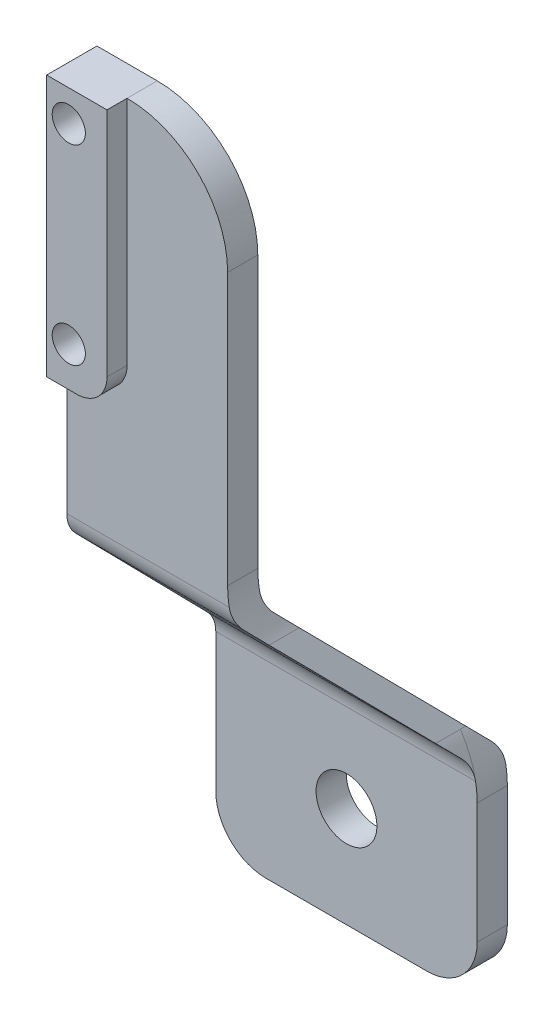
ISO-10303-21;
HEADER;
FILE_DESCRIPTION(('STEP AP214'),'2;1');
FILE_NAME('part.step','',(''),(''),'','','');
FILE_SCHEMA(('AUTOMOTIVE_DESIGN { 1 0 10303 214 1 1 1 1 }'));
ENDSEC;
DATA;
#1=APPLICATION_CONTEXT('core data for automotive mechanical design processes');
#2=APPLICATION_PROTOCOL_DEFINITION('international standard','automotive_design',2000,#1);
#3=PRODUCT_CONTEXT('',#1,'mechanical');
#4=PRODUCT('Part','Part','',(#3));
#5=PRODUCT_RELATED_PRODUCT_CATEGORY('part','',(#4));
#6=PRODUCT_DEFINITION_FORMATION('','',#4);
#7=PRODUCT_DEFINITION_CONTEXT('part definition',#1,'design');
#8=PRODUCT_DEFINITION('design','',#6,#7);
#9=PRODUCT_DEFINITION_SHAPE('','',#8);
#10=(LENGTH_UNIT() NAMED_UNIT(*) SI_UNIT(.MILLI.,.METRE.));
#11=(NAMED_UNIT(*) PLANE_ANGLE_UNIT() SI_UNIT($,.RADIAN.));
#12=(NAMED_UNIT(*) SI_UNIT($,.STERADIAN.) SOLID_ANGLE_UNIT());
#13=UNCERTAINTY_MEASURE_WITH_UNIT(LENGTH_MEASURE(1.E-05),#10,'distance_accuracy_value','');
#14=(GEOMETRIC_REPRESENTATION_CONTEXT(3) GLOBAL_UNCERTAINTY_ASSIGNED_CONTEXT((#13)) GLOBAL_UNIT_ASSIGNED_CONTEXT((#10,
#11,#12)) REPRESENTATION_CONTEXT('',''));
#15=CARTESIAN_POINT('',(0.,0.,0.));
#16=DIRECTION('',(0.,0.,1.));
#17=DIRECTION('',(1.,0.,0.));
#18=AXIS2_PLACEMENT_3D('',#15,#16,#17);
#19=CARTESIAN_POINT('',(0.,0.,0.));
#20=DIRECTION('',(0.,0.,-1.));
#21=DIRECTION('',(-1.,0.,0.));
#22=AXIS2_PLACEMENT_3D('',#19,#20,#21);
#23=PLANE('',#22);
#24=DIRECTION('',(1.,0.,0.));
#25=VECTOR('',#24,1.);
#26=CARTESIAN_POINT('',(-56.0000000000001,14.,0.));
#27=LINE('',#26,#25);
#28=CARTESIAN_POINT('',(-56.0000000000001,14.,0.));
#29=VERTEX_POINT('',#28);
#30=CARTESIAN_POINT('',(-53.0000000000001,14.,0.));
#31=VERTEX_POINT('',#30);
#32=EDGE_CURVE('E230',#29,#31,#27,.T.);
#33=ORIENTED_EDGE('',*,*,#32,.F.);
#34=DIRECTION('',(0.,-1.,0.));
#35=VECTOR('',#34,1.);
#36=CARTESIAN_POINT('',(-56.,0.,0.));
#37=LINE('',#36,#35);
#38=CARTESIAN_POINT('',(-56.,1.22622698302448,0.));
#39=VERTEX_POINT('',#38);
#40=EDGE_CURVE('E310',#29,#39,#37,.T.);
#41=ORIENTED_EDGE('',*,*,#40,.T.);
#42=DIRECTION('',(1.,0.,0.));
#43=VECTOR('',#42,1.);
#44=CARTESIAN_POINT('',(-40.,1.22622698302453,0.));
#45=LINE('',#44,#43);
#46=CARTESIAN_POINT('',(-39.8394318848504,1.22622698302453,0.));
#47=VERTEX_POINT('',#46);
#48=EDGE_CURVE('E324',#39,#47,#45,.T.);
#49=ORIENTED_EDGE('',*,*,#48,.T.);
#50=CARTESIAN_POINT('',(-30.,3.01104635298569,0.));
#51=DIRECTION('',(0.,0.,-1.));
#52=DIRECTION('',(-1.,0.,0.));
#53=AXIS2_PLACEMENT_3D('',#50,#51,#52);
#54=CIRCLE('',#53,10.);
#55=CARTESIAN_POINT('',(-40.,3.01104635298566,0.));
#56=VERTEX_POINT('',#55);
#57=EDGE_CURVE('E436',#47,#56,#54,.T.);
#58=ORIENTED_EDGE('',*,*,#57,.T.);
#59=DIRECTION('',(0.,1.,0.));
#60=VECTOR('',#59,1.);
#61=CARTESIAN_POINT('',(-40.,0.,0.));
#62=LINE('',#61,#60);
#63=CARTESIAN_POINT('',(-40.0000000000001,30.,0.));
#64=VERTEX_POINT('',#63);
#65=EDGE_CURVE('E424',#56,#64,#62,.T.);
#66=ORIENTED_EDGE('',*,*,#65,.T.);
#67=CARTESIAN_POINT('',(-50.0000000000001,30.,0.));
#68=DIRECTION('',(0.,0.,-1.));
#69=DIRECTION('',(-1.,0.,0.));
#70=AXIS2_PLACEMENT_3D('',#67,#68,#69);
#71=CIRCLE('',#70,10.);
#72=CARTESIAN_POINT('',(-50.0000000000001,40.,0.));
#73=VERTEX_POINT('',#72);
#74=EDGE_CURVE('E484',#64,#73,#71,.F.);
#75=ORIENTED_EDGE('',*,*,#74,.T.);
#76=DIRECTION('',(0.,1.,0.));
#77=VECTOR('',#76,1.);
#78=CARTESIAN_POINT('',(-50.0000000000001,40.,0.));
#79=LINE('',#78,#77);
#80=CARTESIAN_POINT('',(-50.0000000000001,17.,0.));
#81=VERTEX_POINT('',#80);
#82=EDGE_CURVE('E228',#81,#73,#79,.T.);
#83=ORIENTED_EDGE('',*,*,#82,.F.);
#84=CARTESIAN_POINT('',(-53.0000000000001,17.,0.));
#85=DIRECTION('',(0.,0.,-1.));
#86=DIRECTION('',(-1.,0.,0.));
#87=AXIS2_PLACEMENT_3D('',#84,#85,#86);
#88=CIRCLE('',#87,3.);
#89=EDGE_CURVE('E335',#81,#31,#88,.T.);
#90=ORIENTED_EDGE('',*,*,#89,.T.);
#91=EDGE_LOOP('',(#33,#41,#49,#58,#66,#75,#83,#90));
#92=FACE_BOUND('',#91,.T.);
#93=ADVANCED_FACE('F42',(#92),#23,.F.);
#94=CARTESIAN_POINT('',(-56.,0.,-3.));
#95=DIRECTION('',(-1.,0.,0.));
#96=DIRECTION('',(0.,-1.,0.));
#97=AXIS2_PLACEMENT_3D('',#94,#95,#96);
#98=PLANE('',#97);
#99=DIRECTION('',(0.,0.713692839578513,0.700458800169117));
#100=VECTOR('',#99,1.);
#101=CARTESIAN_POINT('',(-56.,-15.1,-17.82));
#102=LINE('',#101,#100);
#103=CARTESIAN_POINT('',(-56.,-14.2248505825174,-16.9610785187355));
#104=VERTEX_POINT('',#103);
#105=CARTESIAN_POINT('',(-56.,-0.875149417482865,-3.85892148126446));
#106=VERTEX_POINT('',#105);
#107=EDGE_CURVE('E267',#104,#106,#102,.T.);
#108=ORIENTED_EDGE('',*,*,#107,.F.);
#109=CARTESIAN_POINT('',(-56.,-16.3262269830247,-14.82));
#110=DIRECTION('',(-1.,0.,0.));
#111=DIRECTION('',(0.,-1.,0.));
#112=AXIS2_PLACEMENT_3D('',#109,#110,#111);
#113=CIRCLE('',#112,3.);
#114=CARTESIAN_POINT('',(-56.,-16.3262269830247,-17.82));
#115=VERTEX_POINT('',#114);
#116=EDGE_CURVE('E319',#104,#115,#113,.T.);
#117=ORIENTED_EDGE('',*,*,#116,.T.);
#118=DIRECTION('',(0.,-1.,0.));
#119=VECTOR('',#118,1.);
#120=CARTESIAN_POINT('',(-56.,-15.1,-17.82));
#121=LINE('',#120,#119);
#122=CARTESIAN_POINT('',(-56.,-30.1000000000001,-17.82));
#123=VERTEX_POINT('',#122);
#124=EDGE_CURVE('E254',#115,#123,#121,.T.);
#125=ORIENTED_EDGE('',*,*,#124,.T.);
#126=DIRECTION('',(0.,0.,-1.));
#127=VECTOR('',#126,1.);
#128=CARTESIAN_POINT('',(-55.9999999999999,-30.1000000000001,-14.82));
#129=LINE('',#128,#127);
#130=CARTESIAN_POINT('',(-56.,-30.1000000000001,-14.82));
#131=VERTEX_POINT('',#130);
#132=EDGE_CURVE('E494',#123,#131,#129,.F.);
#133=ORIENTED_EDGE('',*,*,#132,.T.);
#134=DIRECTION('',(0.,-1.,0.));
#135=VECTOR('',#134,1.);
#136=CARTESIAN_POINT('',(-56.,-15.1,-14.82));
#137=LINE('',#136,#135);
#138=CARTESIAN_POINT('',(-56.,-16.3262269830248,-14.82));
#139=VERTEX_POINT('',#138);
#140=EDGE_CURVE('E274',#139,#131,#137,.T.);
#141=ORIENTED_EDGE('',*,*,#140,.F.);
#142=CARTESIAN_POINT('',(-56.,-16.3262269830248,-11.82));
#143=DIRECTION('',(-1.,0.,0.));
#144=DIRECTION('',(0.,-1.,0.));
#145=AXIS2_PLACEMENT_3D('',#142,#143,#144);
#146=CIRCLE('',#145,3.);
#147=CARTESIAN_POINT('',(-56.,-14.2248505825174,-13.9610785187356));
#148=VERTEX_POINT('',#147);
#149=EDGE_CURVE('E294',#139,#148,#146,.F.);
#150=ORIENTED_EDGE('',*,*,#149,.T.);
#151=DIRECTION('',(0.,0.713692839578513,0.700458800169117));
#152=VECTOR('',#151,1.);
#153=CARTESIAN_POINT('',(-56.,-15.1,-14.82));
#154=LINE('',#153,#152);
#155=CARTESIAN_POINT('',(-56.,-0.875149417482861,-0.858921481264456));
#156=VERTEX_POINT('',#155);
#157=EDGE_CURVE('E263',#148,#156,#154,.T.);
#158=ORIENTED_EDGE('',*,*,#157,.T.);
#159=CARTESIAN_POINT('',(-56.,1.22622698302448,-3.));
#160=DIRECTION('',(-1.,0.,0.));
#161=DIRECTION('',(0.,-1.,0.));
#162=AXIS2_PLACEMENT_3D('',#159,#160,#161);
#163=CIRCLE('',#162,3.);
#164=EDGE_CURVE('E316',#156,#39,#163,.T.);
#165=ORIENTED_EDGE('',*,*,#164,.T.);
#166=ORIENTED_EDGE('',*,*,#40,.F.);
#167=DIRECTION('',(0.,0.,-1.));
#168=VECTOR('',#167,1.);
#169=CARTESIAN_POINT('',(-56.0000000000001,14.,2.));
#170=LINE('',#169,#168);
#171=CARTESIAN_POINT('',(-56.0000000000001,14.,2.));
#172=VERTEX_POINT('',#171);
#173=EDGE_CURVE('E217',#172,#29,#170,.T.);
#174=ORIENTED_EDGE('',*,*,#173,.F.);
#175=DIRECTION('',(0.,-1.,0.));
#176=VECTOR('',#175,1.);
#177=CARTESIAN_POINT('',(-56.0000000000001,40.,2.));
#178=LINE('',#177,#176);
#179=CARTESIAN_POINT('',(-56.0000000000001,40.,2.));
#180=VERTEX_POINT('',#179);
#181=EDGE_CURVE('E212',#180,#172,#178,.T.);
#182=ORIENTED_EDGE('',*,*,#181,.F.);
#183=DIRECTION('',(0.,0.,1.));
#184=VECTOR('',#183,1.);
#185=CARTESIAN_POINT('',(-56.0000000000001,40.,-3.));
#186=LINE('',#185,#184);
#187=CARTESIAN_POINT('',(-56.0000000000001,40.,-3.));
#188=VERTEX_POINT('',#187);
#189=EDGE_CURVE('E198',#188,#180,#186,.T.);
#190=ORIENTED_EDGE('',*,*,#189,.F.);
#191=DIRECTION('',(0.,-1.,0.));
#192=VECTOR('',#191,1.);
#193=CARTESIAN_POINT('',(-56.,0.,-3.));
#194=LINE('',#193,#192);
#195=CARTESIAN_POINT('',(-56.,1.22622698302448,-3.));
#196=VERTEX_POINT('',#195);
#197=EDGE_CURVE('E209',#188,#196,#194,.T.);
#198=ORIENTED_EDGE('',*,*,#197,.T.);
#199=CARTESIAN_POINT('',(-56.,1.22622698302448,-6.));
#200=DIRECTION('',(-1.,0.,0.));
#201=DIRECTION('',(0.,-1.,0.));
#202=AXIS2_PLACEMENT_3D('',#199,#200,#201);
#203=CIRCLE('',#202,3.);
#204=EDGE_CURVE('E291',#196,#106,#203,.F.);
#205=ORIENTED_EDGE('',*,*,#204,.T.);
#206=EDGE_LOOP('',(#108,#117,#125,#133,#141,#150,#158,#165,#166,#174,#182,#190,#198,#205));
#207=FACE_BOUND('',#206,.T.);
#208=ADVANCED_FACE('F214',(#207),#98,.T.);
#209=CARTESIAN_POINT('',(-40.0000000000001,40.,-3.));
#210=DIRECTION('',(0.,1.,0.));
#211=DIRECTION('',(-1.,0.,0.));
#212=AXIS2_PLACEMENT_3D('',#209,#210,#211);
#213=PLANE('',#212);
#214=ORIENTED_EDGE('',*,*,#189,.T.);
#215=DIRECTION('',(-1.,0.,0.));
#216=VECTOR('',#215,1.);
#217=CARTESIAN_POINT('',(-50.0000000000001,40.,2.));
#218=LINE('',#217,#216);
#219=CARTESIAN_POINT('',(-50.0000000000001,40.,2.));
#220=VERTEX_POINT('',#219);
#221=EDGE_CURVE('E203',#220,#180,#218,.T.);
#222=ORIENTED_EDGE('',*,*,#221,.F.);
#223=DIRECTION('',(0.,0.,-1.));
#224=VECTOR('',#223,1.);
#225=CARTESIAN_POINT('',(-50.0000000000001,40.,2.));
#226=LINE('',#225,#224);
#227=EDGE_CURVE('E238',#220,#73,#226,.T.);
#228=ORIENTED_EDGE('',*,*,#227,.T.);
#229=DIRECTION('',(0.,0.,1.));
#230=VECTOR('',#229,1.);
#231=CARTESIAN_POINT('',(-50.0000000000001,40.,-3.));
#232=LINE('',#231,#230);
#233=CARTESIAN_POINT('',(-50.0000000000001,40.,-3.));
#234=VERTEX_POINT('',#233);
#235=EDGE_CURVE('E482',#73,#234,#232,.F.);
#236=ORIENTED_EDGE('',*,*,#235,.T.);
#237=DIRECTION('',(-1.,0.,0.));
#238=VECTOR('',#237,1.);
#239=CARTESIAN_POINT('',(-40.0000000000001,40.,-3.));
#240=LINE('',#239,#238);
#241=EDGE_CURVE('E205',#234,#188,#240,.T.);
#242=ORIENTED_EDGE('',*,*,#241,.T.);
#243=EDGE_LOOP('',(#214,#222,#228,#236,#242));
#244=FACE_BOUND('',#243,.T.);
#245=ADVANCED_FACE('F200',(#244),#213,.T.);
#246=CARTESIAN_POINT('',(-40.,0.,-3.));
#247=DIRECTION('',(1.,0.,0.));
#248=DIRECTION('',(0.,1.,0.));
#249=AXIS2_PLACEMENT_3D('',#246,#247,#248);
#250=PLANE('',#249);
#251=ORIENTED_EDGE('',*,*,#65,.F.);
#252=DIRECTION('',(0.,0.,1.));
#253=VECTOR('',#252,1.);
#254=CARTESIAN_POINT('',(-40.,3.01104635298566,-3.26205051432606));
#255=LINE('',#254,#253);
#256=CARTESIAN_POINT('',(-40.,3.01104635298566,-3.));
#257=VERTEX_POINT('',#256);
#258=EDGE_CURVE('E426',#56,#257,#255,.F.);
#259=ORIENTED_EDGE('',*,*,#258,.T.);
#260=DIRECTION('',(0.,1.,0.));
#261=VECTOR('',#260,1.);
#262=CARTESIAN_POINT('',(-40.,0.,-3.));
#263=LINE('',#262,#261);
#264=CARTESIAN_POINT('',(-40.0000000000001,30.,-3.));
#265=VERTEX_POINT('',#264);
#266=EDGE_CURVE('E540',#257,#265,#263,.T.);
#267=ORIENTED_EDGE('',*,*,#266,.T.);
#268=DIRECTION('',(0.,0.,1.));
#269=VECTOR('',#268,1.);
#270=CARTESIAN_POINT('',(-40.0000000000001,30.,-3.));
#271=LINE('',#270,#269);
#272=EDGE_CURVE('E428',#265,#64,#271,.T.);
#273=ORIENTED_EDGE('',*,*,#272,.T.);
#274=EDGE_LOOP('',(#251,#259,#267,#273));
#275=FACE_BOUND('',#274,.T.);
#276=ADVANCED_FACE('F414',(#275),#250,.T.);
#277=CARTESIAN_POINT('',(0.,0.,-3.));
#278=DIRECTION('',(0.,0.,-1.));
#279=DIRECTION('',(-1.,0.,0.));
#280=AXIS2_PLACEMENT_3D('',#277,#278,#279);
#281=PLANE('',#280);
#282=CARTESIAN_POINT('',(-53.8000000000001,17.9,-3.));
#283=DIRECTION('',(0.,0.,1.));
#284=DIRECTION('',(1.,0.,0.));
#285=AXIS2_PLACEMENT_3D('',#282,#283,#284);
#286=CIRCLE('',#285,1.64999999999999);
#287=CARTESIAN_POINT('',(-52.1500000000001,17.9,-3.));
#288=VERTEX_POINT('',#287);
#289=EDGE_CURVE('E476',#288,#288,#286,.T.);
#290=ORIENTED_EDGE('',*,*,#289,.T.);
#291=EDGE_LOOP('',(#290));
#292=FACE_BOUND('',#291,.T.);
#293=CARTESIAN_POINT('',(-53.8000000000001,36.9,-3.));
#294=DIRECTION('',(0.,0.,1.));
#295=DIRECTION('',(1.,0.,0.));
#296=AXIS2_PLACEMENT_3D('',#293,#294,#295);
#297=CIRCLE('',#296,1.64999999999998);
#298=CARTESIAN_POINT('',(-52.1500000000002,36.9,-3.));
#299=VERTEX_POINT('',#298);
#300=EDGE_CURVE('E431',#299,#299,#297,.T.);
#301=ORIENTED_EDGE('',*,*,#300,.T.);
#302=EDGE_LOOP('',(#301));
#303=FACE_BOUND('',#302,.T.);
#304=ORIENTED_EDGE('',*,*,#241,.F.);
#305=CARTESIAN_POINT('',(-50.0000000000001,30.,-3.));
#306=DIRECTION('',(0.,0.,-1.));
#307=DIRECTION('',(-1.,0.,0.));
#308=AXIS2_PLACEMENT_3D('',#305,#306,#307);
#309=CIRCLE('',#308,10.);
#310=EDGE_CURVE('E479',#234,#265,#309,.T.);
#311=ORIENTED_EDGE('',*,*,#310,.T.);
#312=ORIENTED_EDGE('',*,*,#266,.F.);
#313=CARTESIAN_POINT('',(-30.,3.01104635298569,-3.));
#314=DIRECTION('',(0.,0.,-1.));
#315=DIRECTION('',(-1.,0.,0.));
#316=AXIS2_PLACEMENT_3D('',#313,#314,#315);
#317=CIRCLE('',#316,10.);
#318=CARTESIAN_POINT('',(-39.8394318848505,1.22622698302454,-3.));
#319=VERTEX_POINT('',#318);
#320=EDGE_CURVE('E288',#257,#319,#317,.F.);
#321=ORIENTED_EDGE('',*,*,#320,.T.);
#322=DIRECTION('',(1.,0.,0.));
#323=VECTOR('',#322,1.);
#324=CARTESIAN_POINT('',(-56.,1.22622698302448,-3.));
#325=LINE('',#324,#323);
#326=EDGE_CURVE('E65',#319,#196,#325,.F.);
#327=ORIENTED_EDGE('',*,*,#326,.T.);
#328=ORIENTED_EDGE('',*,*,#197,.F.);
#329=EDGE_LOOP('',(#304,#311,#312,#321,#327,#328));
#330=FACE_BOUND('',#329,.T.);
#331=ADVANCED_FACE('F285',(#292,#303,#330),#281,.T.);
#332=CARTESIAN_POINT('',(-53.8000000000001,36.9,-3.));
#333=DIRECTION('',(0.,0.,1.));
#334=DIRECTION('',(1.,0.,0.));
#335=AXIS2_PLACEMENT_3D('',#332,#333,#334);
#336=CYLINDRICAL_SURFACE('',#335,1.64999999999998);
#337=ORIENTED_EDGE('',*,*,#300,.F.);
#338=EDGE_LOOP('',(#337));
#339=FACE_BOUND('',#338,.T.);
#340=CARTESIAN_POINT('',(-53.8000000000001,36.9,2.));
#341=DIRECTION('',(0.,0.,1.));
#342=DIRECTION('',(1.,0.,0.));
#343=AXIS2_PLACEMENT_3D('',#340,#341,#342);
#344=CIRCLE('',#343,1.64999999999999);
#345=CARTESIAN_POINT('',(-52.1500000000001,36.9,2.));
#346=VERTEX_POINT('',#345);
#347=EDGE_CURVE('E233',#346,#346,#344,.T.);
#348=ORIENTED_EDGE('',*,*,#347,.T.);
#349=EDGE_LOOP('',(#348));
#350=FACE_BOUND('',#349,.T.);
#351=ADVANCED_FACE('F420',(#339,#350),#336,.F.);
#352=CARTESIAN_POINT('',(-53.8000000000001,17.9,-3.));
#353=DIRECTION('',(0.,0.,1.));
#354=DIRECTION('',(1.,0.,0.));
#355=AXIS2_PLACEMENT_3D('',#352,#353,#354);
#356=CYLINDRICAL_SURFACE('',#355,1.64999999999999);
#357=ORIENTED_EDGE('',*,*,#289,.F.);
#358=EDGE_LOOP('',(#357));
#359=FACE_BOUND('',#358,.T.);
#360=CARTESIAN_POINT('',(-53.8000000000001,17.9,2.));
#361=DIRECTION('',(0.,0.,1.));
#362=DIRECTION('',(1.,0.,0.));
#363=AXIS2_PLACEMENT_3D('',#360,#361,#362);
#364=CIRCLE('',#363,1.65);
#365=CARTESIAN_POINT('',(-52.1500000000001,17.9,2.));
#366=VERTEX_POINT('',#365);
#367=EDGE_CURVE('E564',#366,#366,#364,.T.);
#368=ORIENTED_EDGE('',*,*,#367,.T.);
#369=EDGE_LOOP('',(#368));
#370=FACE_BOUND('',#369,.T.);
#371=ADVANCED_FACE('F558',(#359,#370),#356,.F.);
#372=CARTESIAN_POINT('',(0.,1.49973729030137,-1.52807240779692));
#373=DIRECTION('',(0.,0.700458800169117,-0.713692839578513));
#374=DIRECTION('',(0.,0.713692839578513,0.700458800169117));
#375=AXIS2_PLACEMENT_3D('',#372,#373,#374);
#376=PLANE('',#375);
#377=DIRECTION('',(-0.427318275895479,0.64525059660217,0.633285684877101));
#378=VECTOR('',#377,1.);
#379=CARTESIAN_POINT('',(-30.,-15.1,-17.82));
#380=LINE('',#379,#378);
#381=CARTESIAN_POINT('',(-31.6625468757024,-12.5895542176894,-15.356105530209));
#382=VERTEX_POINT('',#381);
#383=CARTESIAN_POINT('',(-38.3374531242976,-2.51044578231076,-5.46389446979097));
#384=VERTEX_POINT('',#383);
#385=EDGE_CURVE('E278',#382,#384,#380,.T.);
#386=ORIENTED_EDGE('',*,*,#385,.F.);
#387=CARTESIAN_POINT('',(-40.,-18.1110463529858,-20.7752123808775));
#388=DIRECTION('',(0.,0.700458800169117,-0.713692839578513));
#389=DIRECTION('',(0.,0.713692839578513,0.700458800169117));
#390=AXIS2_PLACEMENT_3D('',#387,#388,#389);
#391=ELLIPSE('',#390,14.011629997445,10.);
#392=CARTESIAN_POINT('',(-30.7860170157748,-14.2248505825173,-16.9610785187355));
#393=VERTEX_POINT('',#392);
#394=EDGE_CURVE('E387',#382,#393,#391,.T.);
#395=ORIENTED_EDGE('',*,*,#394,.T.);
#396=DIRECTION('',(-1.,0.,0.));
#397=VECTOR('',#396,1.);
#398=CARTESIAN_POINT('',(-56.,-14.2248505825174,-16.9610785187355));
#399=LINE('',#398,#397);
#400=EDGE_CURVE('E314',#393,#104,#399,.T.);
#401=ORIENTED_EDGE('',*,*,#400,.T.);
#402=ORIENTED_EDGE('',*,*,#107,.T.);
#403=DIRECTION('',(1.,0.,0.));
#404=VECTOR('',#403,1.);
#405=CARTESIAN_POINT('',(-40.,-0.875149417482812,-3.85892148126446));
#406=LINE('',#405,#404);
#407=CARTESIAN_POINT('',(-39.2139829842253,-0.87514941748281,-3.85892148126446));
#408=VERTEX_POINT('',#407);
#409=EDGE_CURVE('E58',#106,#408,#406,.T.);
#410=ORIENTED_EDGE('',*,*,#409,.T.);
#411=CARTESIAN_POINT('',(-30.,3.01104635298569,-0.044787619122518));
#412=DIRECTION('',(0.,0.700458800169117,-0.713692839578513));
#413=DIRECTION('',(0.,-0.713692839578513,-0.700458800169117));
#414=AXIS2_PLACEMENT_3D('',#411,#412,#413);
#415=ELLIPSE('',#414,14.011629997445,10.);
#416=EDGE_CURVE('E12',#408,#384,#415,.F.);
#417=ORIENTED_EDGE('',*,*,#416,.T.);
#418=EDGE_LOOP('',(#386,#395,#401,#402,#410,#417));
#419=FACE_BOUND('',#418,.T.);
#420=ADVANCED_FACE('F461',(#419),#376,.T.);
#421=CARTESIAN_POINT('',(0.,0.,0.));
#422=DIRECTION('',(0.,-0.700458800169115,0.713692839578515));
#423=DIRECTION('',(0.,-0.713692839578515,-0.700458800169115));
#424=AXIS2_PLACEMENT_3D('',#421,#422,#423);
#425=PLANE('',#424);
#426=DIRECTION('',(1.,0.,0.));
#427=VECTOR('',#426,1.);
#428=CARTESIAN_POINT('',(-30.,-14.2248505825174,-13.9610785187355));
#429=LINE('',#428,#427);
#430=CARTESIAN_POINT('',(-30.7860170157747,-14.2248505825174,-13.9610785187355));
#431=VERTEX_POINT('',#430);
#432=EDGE_CURVE('E270',#148,#431,#429,.T.);
#433=ORIENTED_EDGE('',*,*,#432,.T.);
#434=CARTESIAN_POINT('',(-40.,-18.1110463529858,-17.7752123808774));
#435=DIRECTION('',(0.,-0.700458800169115,0.713692839578515));
#436=DIRECTION('',(0.,-0.713692839578515,-0.700458800169115));
#437=AXIS2_PLACEMENT_3D('',#434,#435,#436);
#438=ELLIPSE('',#437,14.011629997445,10.);
#439=CARTESIAN_POINT('',(-31.6625468757024,-12.5895542176894,-12.356105530209));
#440=VERTEX_POINT('',#439);
#441=EDGE_CURVE('E347',#431,#440,#438,.T.);
#442=ORIENTED_EDGE('',*,*,#441,.T.);
#443=DIRECTION('',(-0.427318275895479,0.64525059660217,0.633285684877101));
#444=VECTOR('',#443,1.);
#445=CARTESIAN_POINT('',(-30.,-15.1,-14.82));
#446=LINE('',#445,#444);
#447=CARTESIAN_POINT('',(-38.3374531242976,-2.51044578231076,-2.46389446979097));
#448=VERTEX_POINT('',#447);
#449=EDGE_CURVE('E268',#440,#448,#446,.T.);
#450=ORIENTED_EDGE('',*,*,#449,.T.);
#451=CARTESIAN_POINT('',(-30.,3.01104635298569,2.95521238087747));
#452=DIRECTION('',(0.,-0.700458800169115,0.713692839578515));
#453=DIRECTION('',(0.,-0.713692839578515,-0.700458800169115));
#454=AXIS2_PLACEMENT_3D('',#451,#452,#453);
#455=ELLIPSE('',#454,14.011629997445,10.);
#456=CARTESIAN_POINT('',(-39.2139829842253,-0.875149417482809,-0.858921481264456));
#457=VERTEX_POINT('',#456);
#458=EDGE_CURVE('E437',#448,#457,#455,.F.);
#459=ORIENTED_EDGE('',*,*,#458,.T.);
#460=DIRECTION('',(1.,0.,0.));
#461=VECTOR('',#460,1.);
#462=CARTESIAN_POINT('',(-56.,-0.875149417482867,-0.858921481264456));
#463=LINE('',#462,#461);
#464=EDGE_CURVE('E326',#457,#156,#463,.F.);
#465=ORIENTED_EDGE('',*,*,#464,.T.);
#466=ORIENTED_EDGE('',*,*,#157,.F.);
#467=EDGE_LOOP('',(#433,#442,#450,#459,#465,#466));
#468=FACE_BOUND('',#467,.T.);
#469=ADVANCED_FACE('F537',(#468),#425,.T.);
#470=CARTESIAN_POINT('',(-27.8052498399439,-18.4140727416848,0.));
#471=DIRECTION('',(0.833745312429758,0.552149213529645,0.));
#472=DIRECTION('',(-0.552149213529645,0.833745312429758,0.));
#473=AXIS2_PLACEMENT_3D('',#470,#471,#472);
#474=PLANE('',#473);
#475=ORIENTED_EDGE('',*,*,#449,.F.);
#476=DIRECTION('',(0.,0.,1.));
#477=VECTOR('',#476,1.);
#478=CARTESIAN_POINT('',(-31.6625468757024,-12.5895542176894,-14.82));
#479=LINE('',#478,#477);
#480=CARTESIAN_POINT('',(-31.6625468757024,-12.5895542176894,-14.82));
#481=VERTEX_POINT('',#480);
#482=EDGE_CURVE('E529',#440,#481,#479,.F.);
#483=ORIENTED_EDGE('',*,*,#482,.T.);
#484=DIRECTION('',(0.,0.,-1.));
#485=VECTOR('',#484,1.);
#486=CARTESIAN_POINT('',(-31.6625468757024,-12.5895542176894,-17.557949485674));
#487=LINE('',#486,#485);
#488=EDGE_CURVE('E468',#481,#382,#487,.T.);
#489=ORIENTED_EDGE('',*,*,#488,.T.);
#490=ORIENTED_EDGE('',*,*,#385,.T.);
#491=DIRECTION('',(0.,0.,1.));
#492=VECTOR('',#491,1.);
#493=CARTESIAN_POINT('',(-38.3374531242976,-2.51044578231076,-0.262050514326052));
#494=LINE('',#493,#492);
#495=EDGE_CURVE('E458',#384,#448,#494,.T.);
#496=ORIENTED_EDGE('',*,*,#495,.T.);
#497=EDGE_LOOP('',(#475,#483,#489,#490,#496));
#498=FACE_BOUND('',#497,.T.);
#499=ADVANCED_FACE('F464',(#498),#474,.T.);
#500=CARTESIAN_POINT('',(0.,0.,-14.82));
#501=DIRECTION('',(0.,0.,1.));
#502=DIRECTION('',(1.,0.,0.));
#503=AXIS2_PLACEMENT_3D('',#500,#501,#502);
#504=PLANE('',#503);
#505=DIRECTION('',(0.,1.,0.));
#506=VECTOR('',#505,1.);
#507=CARTESIAN_POINT('',(-30.,-15.1,-14.82));
#508=LINE('',#507,#506);
#509=CARTESIAN_POINT('',(-30.,-30.1,-14.82));
#510=VERTEX_POINT('',#509);
#511=CARTESIAN_POINT('',(-30.,-18.1110463529858,-14.82));
#512=VERTEX_POINT('',#511);
#513=EDGE_CURVE('E253',#510,#512,#508,.T.);
#514=ORIENTED_EDGE('',*,*,#513,.T.);
#515=CARTESIAN_POINT('',(-40.,-18.1110463529858,-14.82));
#516=DIRECTION('',(0.,0.,1.));
#517=DIRECTION('',(1.,0.,0.));
#518=AXIS2_PLACEMENT_3D('',#515,#516,#517);
#519=CIRCLE('',#518,10.);
#520=CARTESIAN_POINT('',(-30.1605681151496,-16.3262269830247,-14.82));
#521=VERTEX_POINT('',#520);
#522=EDGE_CURVE('E337',#512,#521,#519,.T.);
#523=ORIENTED_EDGE('',*,*,#522,.T.);
#524=DIRECTION('',(1.,0.,0.));
#525=VECTOR('',#524,1.);
#526=CARTESIAN_POINT('',(-56.,-16.3262269830248,-14.82));
#527=LINE('',#526,#525);
#528=EDGE_CURVE('E273',#521,#139,#527,.F.);
#529=ORIENTED_EDGE('',*,*,#528,.T.);
#530=ORIENTED_EDGE('',*,*,#140,.T.);
#531=CARTESIAN_POINT('',(-50.9999999999999,-30.1,-14.82));
#532=DIRECTION('',(0.,0.,1.));
#533=DIRECTION('',(1.,0.,0.));
#534=AXIS2_PLACEMENT_3D('',#531,#532,#533);
#535=CIRCLE('',#534,5.);
#536=CARTESIAN_POINT('',(-50.9999999999999,-35.1,-14.82));
#537=VERTEX_POINT('',#536);
#538=EDGE_CURVE('E490',#131,#537,#535,.T.);
#539=ORIENTED_EDGE('',*,*,#538,.T.);
#540=DIRECTION('',(1.,0.,0.));
#541=VECTOR('',#540,1.);
#542=CARTESIAN_POINT('',(-30.,-35.1,-14.82));
#543=LINE('',#542,#541);
#544=CARTESIAN_POINT('',(-35.,-35.1,-14.82));
#545=VERTEX_POINT('',#544);
#546=EDGE_CURVE('E250',#537,#545,#543,.T.);
#547=ORIENTED_EDGE('',*,*,#546,.T.);
#548=CARTESIAN_POINT('',(-35.,-30.1,-14.82));
#549=DIRECTION('',(0.,0.,1.));
#550=DIRECTION('',(1.,0.,0.));
#551=AXIS2_PLACEMENT_3D('',#548,#549,#550);
#552=CIRCLE('',#551,5.);
#553=EDGE_CURVE('E492',#545,#510,#552,.T.);
#554=ORIENTED_EDGE('',*,*,#553,.T.);
#555=EDGE_LOOP('',(#514,#523,#529,#530,#539,#547,#554));
#556=FACE_BOUND('',#555,.T.);
#557=CARTESIAN_POINT('',(-43.,-25.1,-14.82));
#558=DIRECTION('',(0.,0.,1.));
#559=DIRECTION('',(-1.,0.,0.));
#560=AXIS2_PLACEMENT_3D('',#557,#558,#559);
#561=CIRCLE('',#560,3.025);
#562=CARTESIAN_POINT('',(-46.025,-25.1,-14.82));
#563=VERTEX_POINT('',#562);
#564=EDGE_CURVE('E244',#563,#563,#561,.T.);
#565=ORIENTED_EDGE('',*,*,#564,.F.);
#566=EDGE_LOOP('',(#565));
#567=FACE_BOUND('',#566,.T.);
#568=ADVANCED_FACE('F515',(#556,#567),#504,.T.);
#569=CARTESIAN_POINT('',(0.,0.,-17.82));
#570=DIRECTION('',(0.,0.,1.));
#571=DIRECTION('',(1.,0.,0.));
#572=AXIS2_PLACEMENT_3D('',#569,#570,#571);
#573=PLANE('',#572);
#574=DIRECTION('',(-1.,0.,0.));
#575=VECTOR('',#574,1.);
#576=CARTESIAN_POINT('',(-30.,-16.3262269830246,-17.82));
#577=LINE('',#576,#575);
#578=CARTESIAN_POINT('',(-30.1605681151496,-16.3262269830246,-17.82));
#579=VERTEX_POINT('',#578);
#580=EDGE_CURVE('E321',#115,#579,#577,.F.);
#581=ORIENTED_EDGE('',*,*,#580,.T.);
#582=CARTESIAN_POINT('',(-40.,-18.1110463529858,-17.82));
#583=DIRECTION('',(0.,0.,1.));
#584=DIRECTION('',(1.,0.,0.));
#585=AXIS2_PLACEMENT_3D('',#582,#583,#584);
#586=CIRCLE('',#585,10.);
#587=CARTESIAN_POINT('',(-30.,-18.1110463529858,-17.82));
#588=VERTEX_POINT('',#587);
#589=EDGE_CURVE('E386',#579,#588,#586,.F.);
#590=ORIENTED_EDGE('',*,*,#589,.T.);
#591=DIRECTION('',(0.,1.,0.));
#592=VECTOR('',#591,1.);
#593=CARTESIAN_POINT('',(-30.,-15.1,-17.82));
#594=LINE('',#593,#592);
#595=CARTESIAN_POINT('',(-30.,-30.1,-17.82));
#596=VERTEX_POINT('',#595);
#597=EDGE_CURVE('E257',#596,#588,#594,.T.);
#598=ORIENTED_EDGE('',*,*,#597,.F.);
#599=CARTESIAN_POINT('',(-35.,-30.1,-17.82));
#600=DIRECTION('',(0.,0.,1.));
#601=DIRECTION('',(1.,0.,0.));
#602=AXIS2_PLACEMENT_3D('',#599,#600,#601);
#603=CIRCLE('',#602,5.);
#604=CARTESIAN_POINT('',(-35.,-35.1,-17.82));
#605=VERTEX_POINT('',#604);
#606=EDGE_CURVE('E302',#596,#605,#603,.F.);
#607=ORIENTED_EDGE('',*,*,#606,.T.);
#608=DIRECTION('',(1.,0.,0.));
#609=VECTOR('',#608,1.);
#610=CARTESIAN_POINT('',(-30.,-35.1,-17.82));
#611=LINE('',#610,#609);
#612=CARTESIAN_POINT('',(-50.9999999999999,-35.1,-17.82));
#613=VERTEX_POINT('',#612);
#614=EDGE_CURVE('E247',#613,#605,#611,.T.);
#615=ORIENTED_EDGE('',*,*,#614,.F.);
#616=CARTESIAN_POINT('',(-50.9999999999999,-30.1,-17.82));
#617=DIRECTION('',(0.,0.,1.));
#618=DIRECTION('',(1.,0.,0.));
#619=AXIS2_PLACEMENT_3D('',#616,#617,#618);
#620=CIRCLE('',#619,5.);
#621=EDGE_CURVE('E497',#613,#123,#620,.F.);
#622=ORIENTED_EDGE('',*,*,#621,.T.);
#623=ORIENTED_EDGE('',*,*,#124,.F.);
#624=EDGE_LOOP('',(#581,#590,#598,#607,#615,#622,#623));
#625=FACE_BOUND('',#624,.T.);
#626=CARTESIAN_POINT('',(-43.,-25.1,-17.82));
#627=DIRECTION('',(0.,0.,1.));
#628=DIRECTION('',(-1.,0.,0.));
#629=AXIS2_PLACEMENT_3D('',#626,#627,#628);
#630=CIRCLE('',#629,3.025);
#631=CARTESIAN_POINT('',(-46.025,-25.1,-17.82));
#632=VERTEX_POINT('',#631);
#633=EDGE_CURVE('E243',#632,#632,#630,.T.);
#634=ORIENTED_EDGE('',*,*,#633,.T.);
#635=EDGE_LOOP('',(#634));
#636=FACE_BOUND('',#635,.T.);
#637=ADVANCED_FACE('F504',(#625,#636),#573,.F.);
#638=CARTESIAN_POINT('',(-30.,-35.1,-14.82));
#639=DIRECTION('',(0.,1.,0.));
#640=DIRECTION('',(0.,0.,1.));
#641=AXIS2_PLACEMENT_3D('',#638,#639,#640);
#642=PLANE('',#641);
#643=ORIENTED_EDGE('',*,*,#546,.F.);
#644=DIRECTION('',(0.,0.,-1.));
#645=VECTOR('',#644,1.);
#646=CARTESIAN_POINT('',(-50.9999999999999,-35.1,-17.82));
#647=LINE('',#646,#645);
#648=EDGE_CURVE('E299',#537,#613,#647,.T.);
#649=ORIENTED_EDGE('',*,*,#648,.T.);
#650=ORIENTED_EDGE('',*,*,#614,.T.);
#651=DIRECTION('',(0.,0.,-1.));
#652=VECTOR('',#651,1.);
#653=CARTESIAN_POINT('',(-35.,-35.1,-14.82));
#654=LINE('',#653,#652);
#655=EDGE_CURVE('E295',#605,#545,#654,.F.);
#656=ORIENTED_EDGE('',*,*,#655,.T.);
#657=EDGE_LOOP('',(#643,#649,#650,#656));
#658=FACE_BOUND('',#657,.T.);
#659=ADVANCED_FACE('F510',(#658),#642,.F.);
#660=CARTESIAN_POINT('',(-30.,-15.1,-14.82));
#661=DIRECTION('',(-1.,0.,0.));
#662=DIRECTION('',(0.,0.,1.));
#663=AXIS2_PLACEMENT_3D('',#660,#661,#662);
#664=PLANE('',#663);
#665=ORIENTED_EDGE('',*,*,#597,.T.);
#666=DIRECTION('',(0.,0.,-1.));
#667=VECTOR('',#666,1.);
#668=CARTESIAN_POINT('',(-30.,-18.1110463529858,-14.82));
#669=LINE('',#668,#667);
#670=EDGE_CURVE('E438',#588,#512,#669,.F.);
#671=ORIENTED_EDGE('',*,*,#670,.T.);
#672=ORIENTED_EDGE('',*,*,#513,.F.);
#673=DIRECTION('',(0.,0.,-1.));
#674=VECTOR('',#673,1.);
#675=CARTESIAN_POINT('',(-30.,-30.1,-14.82));
#676=LINE('',#675,#674);
#677=EDGE_CURVE('E487',#510,#596,#676,.T.);
#678=ORIENTED_EDGE('',*,*,#677,.T.);
#679=EDGE_LOOP('',(#665,#671,#672,#678));
#680=FACE_BOUND('',#679,.T.);
#681=ADVANCED_FACE('F518',(#680),#664,.F.);
#682=CARTESIAN_POINT('',(-43.,-25.1,-14.82));
#683=DIRECTION('',(0.,0.,-1.));
#684=DIRECTION('',(-1.,0.,0.));
#685=AXIS2_PLACEMENT_3D('',#682,#683,#684);
#686=CYLINDRICAL_SURFACE('',#685,3.025);
#687=ORIENTED_EDGE('',*,*,#564,.T.);
#688=EDGE_LOOP('',(#687));
#689=FACE_BOUND('',#688,.T.);
#690=ORIENTED_EDGE('',*,*,#633,.F.);
#691=EDGE_LOOP('',(#690));
#692=FACE_BOUND('',#691,.T.);
#693=ADVANCED_FACE('F579',(#689,#692),#686,.F.);
#694=CARTESIAN_POINT('',(0.,1.22622698302468,-6.));
#695=DIRECTION('',(-1.,0.,0.));
#696=DIRECTION('',(0.,-1.,0.));
#697=AXIS2_PLACEMENT_3D('',#694,#695,#696);
#698=CYLINDRICAL_SURFACE('',#697,3.);
#699=ORIENTED_EDGE('',*,*,#204,.F.);
#700=ORIENTED_EDGE('',*,*,#326,.F.);
#701=CARTESIAN_POINT('',(-39.8394318848505,1.22622698302454,-3.));
#702=CARTESIAN_POINT('',(-39.8238447227411,1.1402363254649,-2.99999076766664));
#703=CARTESIAN_POINT('',(-39.8071119402423,1.05446912317105,-3.00369672630366));
#704=CARTESIAN_POINT('',(-39.7715557271921,0.884025608936798,-3.01835664305903));
#705=CARTESIAN_POINT('',(-39.7527330787552,0.79934890203935,-3.0293078972451));
#706=CARTESIAN_POINT('',(-39.7132080399489,0.631759558172421,-3.05826000076691));
#707=CARTESIAN_POINT('',(-39.6925077866819,0.548845044963636,-3.07625291070955));
#708=CARTESIAN_POINT('',(-39.6494732157295,0.38524501718027,-3.11904459424252));
#709=CARTESIAN_POINT('',(-39.6271388209841,0.304559607969444,-3.14384368893919));
#710=CARTESIAN_POINT('',(-39.5581671403754,0.0668058148239854,-3.22800609983879));
#711=CARTESIAN_POINT('',(-39.5094800822044,-0.0862995040069095,-3.29719440664327));
#712=CARTESIAN_POINT('',(-39.4094647004726,-0.378018834414068,-3.45948228264789));
#713=CARTESIAN_POINT('',(-39.3581398658769,-0.516651288624142,-3.55255088497977));
#714=CARTESIAN_POINT('',(-39.2914509223023,-0.686355891865882,-3.68815490615512));
#715=CARTESIAN_POINT('',(-39.2758360927616,-0.725337861918609,-3.72096607775957));
#716=CARTESIAN_POINT('',(-39.2447708524557,-0.801550714912985,-3.78850689886388));
#717=CARTESIAN_POINT('',(-39.229320220467,-0.838784273239704,-3.82323342782696));
#718=CARTESIAN_POINT('',(-39.2139829842252,-0.875149417482932,-3.85892148126427));
#719=B_SPLINE_CURVE_WITH_KNOTS('',3,(#701,#702,#703,#704,#705,#706,#707,#708,#709,#710,#711,
#712,#713,#714,#715,#716,#717,#718),.UNSPECIFIED.,.F.,.F.,(4,2,2,2,2,2,2,2,4),(0.,
0.262065752774714,0.524033758172433,0.785707244408581,1.04739307815854,1.56971580259588,
2.09136459621223,2.25119426286775,2.41077081127548),.UNSPECIFIED.);
#720=EDGE_CURVE('E52',#319,#408,#719,.T.);
#721=ORIENTED_EDGE('',*,*,#720,.T.);
#722=ORIENTED_EDGE('',*,*,#409,.F.);
#723=EDGE_LOOP('',(#699,#700,#721,#722));
#724=FACE_BOUND('',#723,.T.);
#725=ADVANCED_FACE('F293',(#724),#698,.F.);
#726=CARTESIAN_POINT('',(0.,-16.3262269830246,-11.82));
#727=DIRECTION('',(-1.,0.,0.));
#728=DIRECTION('',(0.,-1.,0.));
#729=AXIS2_PLACEMENT_3D('',#726,#727,#728);
#730=CYLINDRICAL_SURFACE('',#729,3.);
#731=ORIENTED_EDGE('',*,*,#528,.F.);
#732=CARTESIAN_POINT('',(-30.1605681151496,-16.3262269830247,-14.82));
#733=CARTESIAN_POINT('',(-30.1761552772589,-16.2402363254651,-14.8200092323334));
#734=CARTESIAN_POINT('',(-30.1928880597578,-16.1544691231712,-14.8163032736963));
#735=CARTESIAN_POINT('',(-30.2284442728079,-15.984025608937,-14.801643356941));
#736=CARTESIAN_POINT('',(-30.2472669212448,-15.8993489020395,-14.7906921027549));
#737=CARTESIAN_POINT('',(-30.2867919600511,-15.7317595581726,-14.7617399992331));
#738=CARTESIAN_POINT('',(-30.3074922133182,-15.6488450449638,-14.7437470892905));
#739=CARTESIAN_POINT('',(-30.3505267842705,-15.4852450171804,-14.7009554057575));
#740=CARTESIAN_POINT('',(-30.3728611790159,-15.4045596079696,-14.6761563110608));
#741=CARTESIAN_POINT('',(-30.4418328596246,-15.1668058148242,-14.5919939001612));
#742=CARTESIAN_POINT('',(-30.4905199177956,-15.0137004959933,-14.5228055933567));
#743=CARTESIAN_POINT('',(-30.5905352995274,-14.7219811655861,-14.3605177173521));
#744=CARTESIAN_POINT('',(-30.6418601341231,-14.583348711376,-14.2674491150202));
#745=CARTESIAN_POINT('',(-30.7085490776977,-14.4136441081343,-14.1318450938449));
#746=CARTESIAN_POINT('',(-30.7241639072384,-14.3746621380816,-14.0990339222404));
#747=CARTESIAN_POINT('',(-30.7552291475443,-14.2984492850872,-14.0314931011361));
#748=CARTESIAN_POINT('',(-30.770679779533,-14.2612157267605,-13.996766572173));
#749=CARTESIAN_POINT('',(-30.7860170157748,-14.2248505825172,-13.9610785187357));
#750=B_SPLINE_CURVE_WITH_KNOTS('',3,(#732,#733,#734,#735,#736,#737,#738,#739,#740,#741,#742,
#743,#744,#745,#746,#747,#748,#749),.UNSPECIFIED.,.F.,.F.,(4,2,2,2,2,2,2,2,4),(0.,
0.262065752774718,0.524033758172432,0.785707244408578,1.04739307815853,1.56971580259587,
2.09136459621222,2.25119426286774,2.41077081127548),.UNSPECIFIED.);
#751=EDGE_CURVE('E340',#521,#431,#750,.T.);
#752=ORIENTED_EDGE('',*,*,#751,.T.);
#753=ORIENTED_EDGE('',*,*,#432,.F.);
#754=ORIENTED_EDGE('',*,*,#149,.F.);
#755=EDGE_LOOP('',(#731,#752,#753,#754));
#756=FACE_BOUND('',#755,.T.);
#757=ADVANCED_FACE('F352',(#756),#730,.F.);
#758=CARTESIAN_POINT('',(-50.9999999999999,-30.1,-14.82));
#759=DIRECTION('',(0.,0.,1.));
#760=DIRECTION('',(1.,0.,0.));
#761=AXIS2_PLACEMENT_3D('',#758,#759,#760);
#762=CYLINDRICAL_SURFACE('',#761,5.);
#763=ORIENTED_EDGE('',*,*,#538,.F.);
#764=ORIENTED_EDGE('',*,*,#132,.F.);
#765=ORIENTED_EDGE('',*,*,#621,.F.);
#766=ORIENTED_EDGE('',*,*,#648,.F.);
#767=EDGE_LOOP('',(#763,#764,#765,#766));
#768=FACE_BOUND('',#767,.T.);
#769=ADVANCED_FACE('F357',(#768),#762,.T.);
#770=CARTESIAN_POINT('',(-35.,-30.1,-14.82));
#771=DIRECTION('',(0.,0.,-1.));
#772=DIRECTION('',(-1.,0.,0.));
#773=AXIS2_PLACEMENT_3D('',#770,#771,#772);
#774=CYLINDRICAL_SURFACE('',#773,5.);
#775=ORIENTED_EDGE('',*,*,#553,.F.);
#776=ORIENTED_EDGE('',*,*,#655,.F.);
#777=ORIENTED_EDGE('',*,*,#606,.F.);
#778=ORIENTED_EDGE('',*,*,#677,.F.);
#779=EDGE_LOOP('',(#775,#776,#777,#778));
#780=FACE_BOUND('',#779,.T.);
#781=ADVANCED_FACE('F363',(#780),#774,.T.);
#782=CARTESIAN_POINT('',(-50.0000000000001,30.,-3.));
#783=DIRECTION('',(0.,0.,1.));
#784=DIRECTION('',(1.,0.,0.));
#785=AXIS2_PLACEMENT_3D('',#782,#783,#784);
#786=CYLINDRICAL_SURFACE('',#785,10.);
#787=ORIENTED_EDGE('',*,*,#310,.F.);
#788=ORIENTED_EDGE('',*,*,#235,.F.);
#789=ORIENTED_EDGE('',*,*,#74,.F.);
#790=ORIENTED_EDGE('',*,*,#272,.F.);
#791=EDGE_LOOP('',(#787,#788,#789,#790));
#792=FACE_BOUND('',#791,.T.);
#793=ADVANCED_FACE('F367',(#792),#786,.T.);
#794=CARTESIAN_POINT('',(0.,-16.3262269830245,-14.82));
#795=DIRECTION('',(1.,0.,0.));
#796=DIRECTION('',(0.,1.,0.));
#797=AXIS2_PLACEMENT_3D('',#794,#795,#796);
#798=CYLINDRICAL_SURFACE('',#797,3.);
#799=ORIENTED_EDGE('',*,*,#400,.F.);
#800=CARTESIAN_POINT('',(-30.7860170157748,-14.2248505825173,-16.9610785187355));
#801=CARTESIAN_POINT('',(-30.759811889202,-14.2869766014497,-17.0220451684051));
#802=CARTESIAN_POINT('',(-30.7332786280076,-14.3516471150749,-17.0802145444791));
#803=CARTESIAN_POINT('',(-30.6799998349677,-14.4857463753156,-17.1906939592976));
#804=CARTESIAN_POINT('',(-30.6532542776585,-14.5551757005902,-17.2430032834306));
#805=CARTESIAN_POINT('',(-30.5732021382676,-14.7705472776515,-17.3910424435263));
#806=CARTESIAN_POINT('',(-30.5202561528183,-14.923165208586,-17.4774837221351));
#807=CARTESIAN_POINT('',(-30.4187453105733,-15.2426634158352,-17.6229827755916));
#808=CARTESIAN_POINT('',(-30.3701870736046,-15.4095645263308,-17.6819997130179));
#809=CARTESIAN_POINT('',(-30.302945053486,-15.6666619933991,-17.74793441734));
#810=CARTESIAN_POINT('',(-30.2814866536257,-15.7533742724416,-17.7661389383418));
#811=CARTESIAN_POINT('',(-30.2406622407094,-15.928529412465,-17.7948434273093));
#812=CARTESIAN_POINT('',(-30.2212947950081,-16.0169710388547,-17.8053486994538));
#813=CARTESIAN_POINT('',(-30.195601833422,-16.1424993083294,-17.8145939692785));
#814=CARTESIAN_POINT('',(-30.1883094555756,-16.179174155749,-17.8166194707443));
#815=CARTESIAN_POINT('',(-30.1741323474564,-16.2526272601918,-17.8193218610811));
#816=CARTESIAN_POINT('',(-30.1672473549071,-16.2894054343569,-17.8199996270019));
#817=CARTESIAN_POINT('',(-30.1605681151496,-16.3262269830246,-17.82));
#818=B_SPLINE_CURVE_WITH_KNOTS('',3,(#800,#801,#802,#803,#804,#805,#806,#807,#808,#809,#810,
#811,#812,#813,#814,#815,#816,#817),.UNSPECIFIED.,.F.,.F.,(4,2,2,2,2,2,2,2,4),(0.,
0.272545500321594,0.545124200454119,1.09205224819633,1.63979213377084,1.91298846020791,
2.18599639842408,2.29831837982636,2.41056724283936),.UNSPECIFIED.);
#819=EDGE_CURVE('E380',#393,#579,#818,.T.);
#820=ORIENTED_EDGE('',*,*,#819,.T.);
#821=ORIENTED_EDGE('',*,*,#580,.F.);
#822=ORIENTED_EDGE('',*,*,#116,.F.);
#823=EDGE_LOOP('',(#799,#820,#821,#822));
#824=FACE_BOUND('',#823,.T.);
#825=ADVANCED_FACE('F371',(#824),#798,.T.);
#826=CARTESIAN_POINT('',(0.,1.22622698302467,-3.));
#827=DIRECTION('',(-1.,0.,0.));
#828=DIRECTION('',(0.,-1.,0.));
#829=AXIS2_PLACEMENT_3D('',#826,#827,#828);
#830=CYLINDRICAL_SURFACE('',#829,3.);
#831=ORIENTED_EDGE('',*,*,#164,.F.);
#832=ORIENTED_EDGE('',*,*,#464,.F.);
#833=CARTESIAN_POINT('',(-39.2139829842253,-0.875149417482809,-0.858921481264456));
#834=CARTESIAN_POINT('',(-39.2401881107981,-0.81302339855042,-0.79795483159489));
#835=CARTESIAN_POINT('',(-39.2667213719924,-0.748352884925205,-0.739785455520901));
#836=CARTESIAN_POINT('',(-39.3200001650323,-0.61425362468443,-0.629306040702418));
#837=CARTESIAN_POINT('',(-39.3467457223416,-0.544824299409913,-0.576996716569391));
#838=CARTESIAN_POINT('',(-39.4267978617325,-0.329452722348529,-0.428957556473688));
#839=CARTESIAN_POINT('',(-39.4797438471817,-0.176834791414063,-0.3425162778649));
#840=CARTESIAN_POINT('',(-39.5812546894267,0.142663415835098,-0.1970172244084));
#841=CARTESIAN_POINT('',(-39.6298129263955,0.30956452633075,-0.138000286982143));
#842=CARTESIAN_POINT('',(-39.6970549465141,0.566661993399031,-0.0720655826600275));
#843=CARTESIAN_POINT('',(-39.7185133463743,0.653374272441495,-0.0538610616582443));
#844=CARTESIAN_POINT('',(-39.7593377592906,0.828529412464919,-0.0251565726907066));
#845=CARTESIAN_POINT('',(-39.7787052049919,0.916971038854656,-0.0146513005462209));
#846=CARTESIAN_POINT('',(-39.804398166578,1.04249930832936,-0.00540603072151711));
#847=CARTESIAN_POINT('',(-39.8116905444245,1.07917415574888,-0.00338052925567257));
#848=CARTESIAN_POINT('',(-39.8258676525436,1.15262726019168,-0.000678138918872683));
#849=CARTESIAN_POINT('',(-39.832752645093,1.1894054343568,-3.72998120692566E-07));
#850=CARTESIAN_POINT('',(-39.8394318848504,1.22622698302453,0.));
#851=B_SPLINE_CURVE_WITH_KNOTS('',3,(#833,#834,#835,#836,#837,#838,#839,#840,#841,#842,#843,
#844,#845,#846,#847,#848,#849,#850),.UNSPECIFIED.,.F.,.F.,(4,2,2,2,2,2,2,2,4),(0.,
0.272545500321592,0.545124200454113,1.09205224819632,1.63979213377082,1.91298846020789,
2.18599639842406,2.29831837982634,2.41056724283933),.UNSPECIFIED.);
#852=EDGE_CURVE('E441',#457,#47,#851,.T.);
#853=ORIENTED_EDGE('',*,*,#852,.T.);
#854=ORIENTED_EDGE('',*,*,#48,.F.);
#855=EDGE_LOOP('',(#831,#832,#853,#854));
#856=FACE_BOUND('',#855,.T.);
#857=ADVANCED_FACE('F376',(#856),#830,.T.);
#858=CARTESIAN_POINT('',(0.,0.,2.));
#859=DIRECTION('',(0.,0.,1.));
#860=DIRECTION('',(1.,0.,0.));
#861=AXIS2_PLACEMENT_3D('',#858,#859,#860);
#862=PLANE('',#861);
#863=ORIENTED_EDGE('',*,*,#347,.F.);
#864=EDGE_LOOP('',(#863));
#865=FACE_BOUND('',#864,.T.);
#866=DIRECTION('',(1.,0.,0.));
#867=VECTOR('',#866,1.);
#868=CARTESIAN_POINT('',(-56.0000000000001,14.,2.));
#869=LINE('',#868,#867);
#870=CARTESIAN_POINT('',(-53.0000000000001,14.,2.));
#871=VERTEX_POINT('',#870);
#872=EDGE_CURVE('E221',#172,#871,#869,.T.);
#873=ORIENTED_EDGE('',*,*,#872,.T.);
#874=CARTESIAN_POINT('',(-53.0000000000001,17.,2.));
#875=DIRECTION('',(0.,0.,1.));
#876=DIRECTION('',(1.,0.,0.));
#877=AXIS2_PLACEMENT_3D('',#874,#875,#876);
#878=CIRCLE('',#877,3.);
#879=CARTESIAN_POINT('',(-50.0000000000001,17.,2.));
#880=VERTEX_POINT('',#879);
#881=EDGE_CURVE('E333',#871,#880,#878,.T.);
#882=ORIENTED_EDGE('',*,*,#881,.T.);
#883=DIRECTION('',(0.,1.,0.));
#884=VECTOR('',#883,1.);
#885=CARTESIAN_POINT('',(-50.0000000000001,40.,2.));
#886=LINE('',#885,#884);
#887=EDGE_CURVE('E226',#880,#220,#886,.T.);
#888=ORIENTED_EDGE('',*,*,#887,.T.);
#889=ORIENTED_EDGE('',*,*,#221,.T.);
#890=ORIENTED_EDGE('',*,*,#181,.T.);
#891=EDGE_LOOP('',(#873,#882,#888,#889,#890));
#892=FACE_BOUND('',#891,.T.);
#893=ORIENTED_EDGE('',*,*,#367,.F.);
#894=EDGE_LOOP('',(#893));
#895=FACE_BOUND('',#894,.T.);
#896=ADVANCED_FACE('F223',(#865,#892,#895),#862,.T.);
#897=CARTESIAN_POINT('',(-56.0000000000001,14.,2.));
#898=DIRECTION('',(0.,1.,0.));
#899=DIRECTION('',(0.,0.,1.));
#900=AXIS2_PLACEMENT_3D('',#897,#898,#899);
#901=PLANE('',#900);
#902=ORIENTED_EDGE('',*,*,#32,.T.);
#903=DIRECTION('',(0.,0.,-1.));
#904=VECTOR('',#903,1.);
#905=CARTESIAN_POINT('',(-53.0000000000001,14.,2.));
#906=LINE('',#905,#904);
#907=EDGE_CURVE('E331',#31,#871,#906,.F.);
#908=ORIENTED_EDGE('',*,*,#907,.T.);
#909=ORIENTED_EDGE('',*,*,#872,.F.);
#910=ORIENTED_EDGE('',*,*,#173,.T.);
#911=EDGE_LOOP('',(#902,#908,#909,#910));
#912=FACE_BOUND('',#911,.T.);
#913=ADVANCED_FACE('F542',(#912),#901,.F.);
#914=CARTESIAN_POINT('',(-50.0000000000001,40.,2.));
#915=DIRECTION('',(-1.,0.,0.));
#916=DIRECTION('',(0.,-1.,0.));
#917=AXIS2_PLACEMENT_3D('',#914,#915,#916);
#918=PLANE('',#917);
#919=ORIENTED_EDGE('',*,*,#887,.F.);
#920=DIRECTION('',(0.,0.,-1.));
#921=VECTOR('',#920,1.);
#922=CARTESIAN_POINT('',(-50.0000000000001,17.,2.));
#923=LINE('',#922,#921);
#924=EDGE_CURVE('E328',#880,#81,#923,.T.);
#925=ORIENTED_EDGE('',*,*,#924,.T.);
#926=ORIENTED_EDGE('',*,*,#82,.T.);
#927=ORIENTED_EDGE('',*,*,#227,.F.);
#928=EDGE_LOOP('',(#919,#925,#926,#927));
#929=FACE_BOUND('',#928,.T.);
#930=ADVANCED_FACE('F400',(#929),#918,.F.);
#931=CARTESIAN_POINT('',(-53.0000000000001,17.,2.));
#932=DIRECTION('',(0.,0.,-1.));
#933=DIRECTION('',(-1.,0.,0.));
#934=AXIS2_PLACEMENT_3D('',#931,#932,#933);
#935=CYLINDRICAL_SURFACE('',#934,3.);
#936=ORIENTED_EDGE('',*,*,#881,.F.);
#937=ORIENTED_EDGE('',*,*,#907,.F.);
#938=ORIENTED_EDGE('',*,*,#89,.F.);
#939=ORIENTED_EDGE('',*,*,#924,.F.);
#940=EDGE_LOOP('',(#936,#937,#938,#939));
#941=FACE_BOUND('',#940,.T.);
#942=ADVANCED_FACE('F393',(#941),#935,.T.);
#943=CARTESIAN_POINT('',(-40.,-18.1110463529858,0.));
#944=DIRECTION('',(0.,0.,1.));
#945=DIRECTION('',(1.,0.,0.));
#946=AXIS2_PLACEMENT_3D('',#943,#944,#945);
#947=CYLINDRICAL_SURFACE('',#946,10.);
#948=ORIENTED_EDGE('',*,*,#394,.F.);
#949=ORIENTED_EDGE('',*,*,#488,.F.);
#950=CARTESIAN_POINT('',(-40.,-18.1110463529858,-14.82));
#951=DIRECTION('',(0.,0.,1.));
#952=DIRECTION('',(1.,0.,0.));
#953=AXIS2_PLACEMENT_3D('',#950,#951,#952);
#954=CIRCLE('',#953,10.);
#955=EDGE_CURVE('E47',#521,#481,#954,.T.);
#956=ORIENTED_EDGE('',*,*,#955,.F.);
#957=ORIENTED_EDGE('',*,*,#522,.F.);
#958=ORIENTED_EDGE('',*,*,#670,.F.);
#959=ORIENTED_EDGE('',*,*,#589,.F.);
#960=ORIENTED_EDGE('',*,*,#819,.F.);
#961=EDGE_LOOP('',(#948,#949,#956,#957,#958,#959,#960));
#962=FACE_BOUND('',#961,.T.);
#963=ADVANCED_FACE('F390',(#962),#947,.T.);
#964=CARTESIAN_POINT('',(-40.,-18.1110463529858,-14.82));
#965=DIRECTION('',(0.,0.,-1.));
#966=DIRECTION('',(-1.,0.,0.));
#967=AXIS2_PLACEMENT_3D('',#964,#965,#966);
#968=CYLINDRICAL_SURFACE('',#967,10.);
#969=ORIENTED_EDGE('',*,*,#955,.T.);
#970=ORIENTED_EDGE('',*,*,#482,.F.);
#971=ORIENTED_EDGE('',*,*,#441,.F.);
#972=ORIENTED_EDGE('',*,*,#751,.F.);
#973=EDGE_LOOP('',(#969,#970,#971,#972));
#974=FACE_BOUND('',#973,.T.);
#975=ADVANCED_FACE('F349',(#974),#968,.T.);
#976=CARTESIAN_POINT('',(-30.,3.01104635298569,0.));
#977=DIRECTION('',(0.,0.,-1.));
#978=DIRECTION('',(-1.,0.,0.));
#979=AXIS2_PLACEMENT_3D('',#976,#977,#978);
#980=CYLINDRICAL_SURFACE('',#979,10.);
#981=ORIENTED_EDGE('',*,*,#320,.F.);
#982=ORIENTED_EDGE('',*,*,#258,.F.);
#983=ORIENTED_EDGE('',*,*,#57,.F.);
#984=ORIENTED_EDGE('',*,*,#852,.F.);
#985=ORIENTED_EDGE('',*,*,#458,.F.);
#986=ORIENTED_EDGE('',*,*,#495,.F.);
#987=ORIENTED_EDGE('',*,*,#416,.F.);
#988=ORIENTED_EDGE('',*,*,#720,.F.);
#989=EDGE_LOOP('',(#981,#982,#983,#984,#985,#986,#987,#988));
#990=FACE_BOUND('',#989,.T.);
#991=ADVANCED_FACE('F44',(#990),#980,.F.);
#992=CLOSED_SHELL('',(#93,#208,#245,#276,#331,#351,#371,#420,#469,#499,#568,#637,#659,#681,#693,
#725,#757,#769,#781,#793,#825,#857,#896,#913,#930,#942,#963,#975,#991));
#993=MANIFOLD_SOLID_BREP('B2',#992);
#994=ADVANCED_BREP_SHAPE_REPRESENTATION('',(#18,#993),#14);
#995=SHAPE_DEFINITION_REPRESENTATION(#9,#994);
ENDSEC;
END-ISO-10303-21;
